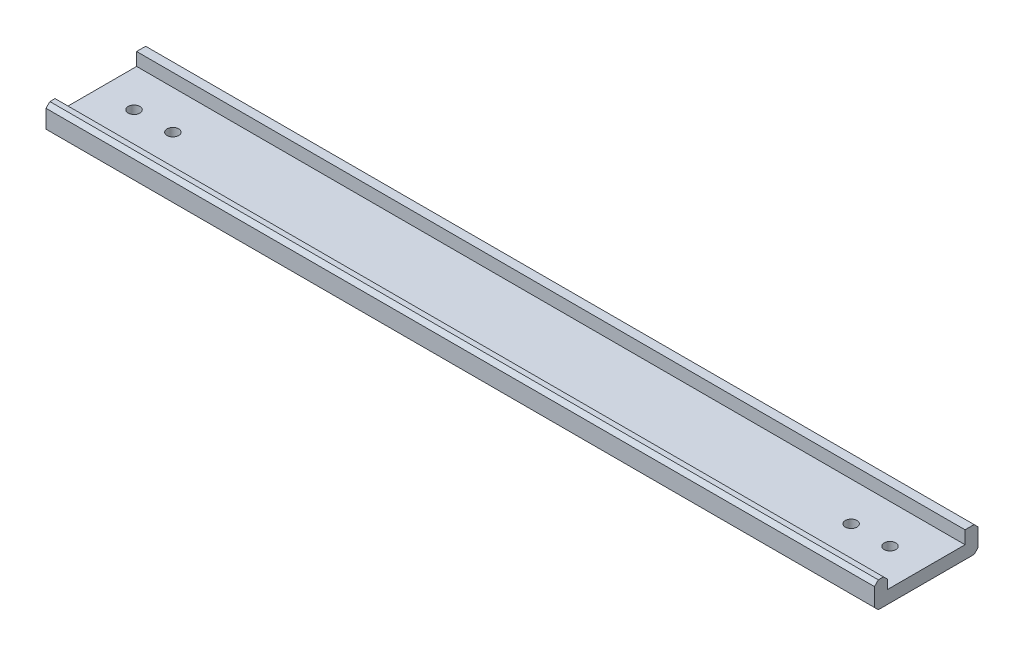
ISO-10303-21;
HEADER;
FILE_DESCRIPTION(('STEP AP214'),'2;1');
FILE_NAME('part.step','',(''),(''),'','','');
FILE_SCHEMA(('AUTOMOTIVE_DESIGN { 1 0 10303 214 1 1 1 1 }'));
ENDSEC;
DATA;
#1=APPLICATION_CONTEXT('core data for automotive mechanical design processes');
#2=APPLICATION_PROTOCOL_DEFINITION('international standard','automotive_design',2000,#1);
#3=PRODUCT_CONTEXT('',#1,'mechanical');
#4=PRODUCT('Part','Part','',(#3));
#5=PRODUCT_RELATED_PRODUCT_CATEGORY('part','',(#4));
#6=PRODUCT_DEFINITION_FORMATION('','',#4);
#7=PRODUCT_DEFINITION_CONTEXT('part definition',#1,'design');
#8=PRODUCT_DEFINITION('design','',#6,#7);
#9=PRODUCT_DEFINITION_SHAPE('','',#8);
#10=(LENGTH_UNIT() NAMED_UNIT(*) SI_UNIT(.MILLI.,.METRE.));
#11=(NAMED_UNIT(*) PLANE_ANGLE_UNIT() SI_UNIT($,.RADIAN.));
#12=(NAMED_UNIT(*) SI_UNIT($,.STERADIAN.) SOLID_ANGLE_UNIT());
#13=UNCERTAINTY_MEASURE_WITH_UNIT(LENGTH_MEASURE(1.E-05),#10,'distance_accuracy_value','');
#14=(GEOMETRIC_REPRESENTATION_CONTEXT(3) GLOBAL_UNCERTAINTY_ASSIGNED_CONTEXT((#13)) GLOBAL_UNIT_ASSIGNED_CONTEXT((#10,
#11,#12)) REPRESENTATION_CONTEXT('',''));
#15=CARTESIAN_POINT('',(0.,0.,0.));
#16=DIRECTION('',(0.,0.,1.));
#17=DIRECTION('',(1.,0.,0.));
#18=AXIS2_PLACEMENT_3D('',#15,#16,#17);
#19=CARTESIAN_POINT('',(160.,5.00000000000001,-15.));
#20=DIRECTION('',(0.,0.,-1.));
#21=DIRECTION('',(0.,1.,0.));
#22=AXIS2_PLACEMENT_3D('',#19,#20,#21);
#23=PLANE('',#22);
#24=DIRECTION('',(0.,-1.,0.));
#25=VECTOR('',#24,1.);
#26=CARTESIAN_POINT('',(-160.,5.00000000000001,-15.));
#27=LINE('',#26,#25);
#28=CARTESIAN_POINT('',(-160.,5.00000000000001,-15.));
#29=VERTEX_POINT('',#28);
#30=CARTESIAN_POINT('',(-160.,0.,-15.));
#31=VERTEX_POINT('',#30);
#32=EDGE_CURVE('E164',#29,#31,#27,.T.);
#33=ORIENTED_EDGE('',*,*,#32,.T.);
#34=DIRECTION('',(-1.,0.,0.));
#35=VECTOR('',#34,1.);
#36=CARTESIAN_POINT('',(160.,0.,-15.));
#37=LINE('',#36,#35);
#38=CARTESIAN_POINT('',(160.,0.,-15.));
#39=VERTEX_POINT('',#38);
#40=EDGE_CURVE('E144',#39,#31,#37,.T.);
#41=ORIENTED_EDGE('',*,*,#40,.F.);
#42=DIRECTION('',(0.,-1.,0.));
#43=VECTOR('',#42,1.);
#44=CARTESIAN_POINT('',(160.,5.00000000000001,-15.));
#45=LINE('',#44,#43);
#46=CARTESIAN_POINT('',(160.,5.00000000000001,-15.));
#47=VERTEX_POINT('',#46);
#48=EDGE_CURVE('E152',#47,#39,#45,.T.);
#49=ORIENTED_EDGE('',*,*,#48,.F.);
#50=DIRECTION('',(-1.,0.,0.));
#51=VECTOR('',#50,1.);
#52=CARTESIAN_POINT('',(160.,5.00000000000001,-15.));
#53=LINE('',#52,#51);
#54=EDGE_CURVE('E172',#47,#29,#53,.T.);
#55=ORIENTED_EDGE('',*,*,#54,.T.);
#56=EDGE_LOOP('',(#33,#41,#49,#55));
#57=FACE_BOUND('',#56,.T.);
#58=ADVANCED_FACE('F40',(#57),#23,.F.);
#59=CARTESIAN_POINT('',(160.,0.,15.));
#60=DIRECTION('',(0.,-1.,0.));
#61=DIRECTION('',(0.,0.,-1.));
#62=AXIS2_PLACEMENT_3D('',#59,#60,#61);
#63=PLANE('',#62);
#64=CARTESIAN_POINT('',(-146.,0.,0.));
#65=DIRECTION('',(0.,1.,0.));
#66=DIRECTION('',(0.,0.,1.));
#67=AXIS2_PLACEMENT_3D('',#64,#65,#66);
#68=CIRCLE('',#67,2.25000000000001);
#69=CARTESIAN_POINT('',(-146.,0.,2.25000000000001));
#70=VERTEX_POINT('',#69);
#71=EDGE_CURVE('E236',#70,#70,#68,.T.);
#72=ORIENTED_EDGE('',*,*,#71,.F.);
#73=EDGE_LOOP('',(#72));
#74=FACE_BOUND('',#73,.T.);
#75=CARTESIAN_POINT('',(-131.,0.,0.));
#76=DIRECTION('',(0.,1.,0.));
#77=DIRECTION('',(0.,0.,1.));
#78=AXIS2_PLACEMENT_3D('',#75,#76,#77);
#79=CIRCLE('',#78,2.25000000000001);
#80=CARTESIAN_POINT('',(-131.,0.,2.25000000000001));
#81=VERTEX_POINT('',#80);
#82=EDGE_CURVE('E303',#81,#81,#79,.T.);
#83=ORIENTED_EDGE('',*,*,#82,.F.);
#84=EDGE_LOOP('',(#83));
#85=FACE_BOUND('',#84,.T.);
#86=CARTESIAN_POINT('',(131.,0.,0.));
#87=DIRECTION('',(0.,1.,0.));
#88=DIRECTION('',(0.,0.,1.));
#89=AXIS2_PLACEMENT_3D('',#86,#87,#88);
#90=CIRCLE('',#89,2.25000000000001);
#91=CARTESIAN_POINT('',(131.,0.,2.24999999999996));
#92=VERTEX_POINT('',#91);
#93=EDGE_CURVE('E299',#92,#92,#90,.T.);
#94=ORIENTED_EDGE('',*,*,#93,.F.);
#95=EDGE_LOOP('',(#94));
#96=FACE_BOUND('',#95,.T.);
#97=CARTESIAN_POINT('',(146.,0.,0.));
#98=DIRECTION('',(0.,1.,0.));
#99=DIRECTION('',(0.,0.,1.));
#100=AXIS2_PLACEMENT_3D('',#97,#98,#99);
#101=CIRCLE('',#100,2.25000000000001);
#102=CARTESIAN_POINT('',(146.,0.,2.24999999999996));
#103=VERTEX_POINT('',#102);
#104=EDGE_CURVE('E295',#103,#103,#101,.T.);
#105=ORIENTED_EDGE('',*,*,#104,.F.);
#106=EDGE_LOOP('',(#105));
#107=FACE_BOUND('',#106,.T.);
#108=DIRECTION('',(0.,0.,1.));
#109=VECTOR('',#108,1.);
#110=CARTESIAN_POINT('',(-160.,0.,15.));
#111=LINE('',#110,#109);
#112=CARTESIAN_POINT('',(-160.,0.,15.));
#113=VERTEX_POINT('',#112);
#114=EDGE_CURVE('E249',#31,#113,#111,.T.);
#115=ORIENTED_EDGE('',*,*,#114,.T.);
#116=DIRECTION('',(-1.,0.,0.));
#117=VECTOR('',#116,1.);
#118=CARTESIAN_POINT('',(160.,0.,15.));
#119=LINE('',#118,#117);
#120=CARTESIAN_POINT('',(160.,0.,15.));
#121=VERTEX_POINT('',#120);
#122=EDGE_CURVE('E147',#121,#113,#119,.T.);
#123=ORIENTED_EDGE('',*,*,#122,.F.);
#124=DIRECTION('',(0.,0.,1.));
#125=VECTOR('',#124,1.);
#126=CARTESIAN_POINT('',(160.,0.,15.));
#127=LINE('',#126,#125);
#128=EDGE_CURVE('E140',#39,#121,#127,.T.);
#129=ORIENTED_EDGE('',*,*,#128,.F.);
#130=ORIENTED_EDGE('',*,*,#40,.T.);
#131=EDGE_LOOP('',(#115,#123,#129,#130));
#132=FACE_BOUND('',#131,.T.);
#133=ADVANCED_FACE('F142',(#74,#85,#96,#107,#132),#63,.F.);
#134=CARTESIAN_POINT('',(160.,0.,15.));
#135=DIRECTION('',(0.,0.,1.));
#136=DIRECTION('',(1.,0.,0.));
#137=AXIS2_PLACEMENT_3D('',#134,#135,#136);
#138=PLANE('',#137);
#139=DIRECTION('',(0.,1.,0.));
#140=VECTOR('',#139,1.);
#141=CARTESIAN_POINT('',(-160.,0.,15.));
#142=LINE('',#141,#140);
#143=CARTESIAN_POINT('',(-160.,3.5,15.));
#144=VERTEX_POINT('',#143);
#145=EDGE_CURVE('E252',#113,#144,#142,.T.);
#146=ORIENTED_EDGE('',*,*,#145,.T.);
#147=DIRECTION('',(1.,0.,0.));
#148=VECTOR('',#147,1.);
#149=CARTESIAN_POINT('',(160.,3.5,15.));
#150=LINE('',#149,#148);
#151=CARTESIAN_POINT('',(160.,3.5,15.));
#152=VERTEX_POINT('',#151);
#153=EDGE_CURVE('E194',#144,#152,#150,.T.);
#154=ORIENTED_EDGE('',*,*,#153,.T.);
#155=DIRECTION('',(0.,1.,0.));
#156=VECTOR('',#155,1.);
#157=CARTESIAN_POINT('',(160.,0.,15.));
#158=LINE('',#157,#156);
#159=EDGE_CURVE('E151',#121,#152,#158,.T.);
#160=ORIENTED_EDGE('',*,*,#159,.F.);
#161=ORIENTED_EDGE('',*,*,#122,.T.);
#162=EDGE_LOOP('',(#146,#154,#160,#161));
#163=FACE_BOUND('',#162,.T.);
#164=ADVANCED_FACE('F316',(#163),#138,.F.);
#165=CARTESIAN_POINT('',(160.,5.,15.));
#166=DIRECTION('',(0.,-1.,0.));
#167=DIRECTION('',(0.,0.,-1.));
#168=AXIS2_PLACEMENT_3D('',#165,#166,#167);
#169=PLANE('',#168);
#170=DIRECTION('',(0.,0.,1.));
#171=VECTOR('',#170,1.);
#172=CARTESIAN_POINT('',(160.,5.,15.));
#173=LINE('',#172,#171);
#174=CARTESIAN_POINT('',(160.,5.,16.5));
#175=VERTEX_POINT('',#174);
#176=CARTESIAN_POINT('',(160.,5.,18.5));
#177=VERTEX_POINT('',#176);
#178=EDGE_CURVE('E289',#175,#177,#173,.T.);
#179=ORIENTED_EDGE('',*,*,#178,.F.);
#180=DIRECTION('',(-1.,0.,0.));
#181=VECTOR('',#180,1.);
#182=CARTESIAN_POINT('',(160.,5.,16.5));
#183=LINE('',#182,#181);
#184=CARTESIAN_POINT('',(-160.,5.,16.5));
#185=VERTEX_POINT('',#184);
#186=EDGE_CURVE('E170',#175,#185,#183,.T.);
#187=ORIENTED_EDGE('',*,*,#186,.T.);
#188=DIRECTION('',(0.,0.,1.));
#189=VECTOR('',#188,1.);
#190=CARTESIAN_POINT('',(-160.,5.,15.));
#191=LINE('',#190,#189);
#192=CARTESIAN_POINT('',(-160.,5.,18.5));
#193=VERTEX_POINT('',#192);
#194=EDGE_CURVE('E260',#185,#193,#191,.T.);
#195=ORIENTED_EDGE('',*,*,#194,.T.);
#196=DIRECTION('',(1.,0.,0.));
#197=VECTOR('',#196,1.);
#198=CARTESIAN_POINT('',(160.,5.,18.5));
#199=LINE('',#198,#197);
#200=EDGE_CURVE('E166',#193,#177,#199,.T.);
#201=ORIENTED_EDGE('',*,*,#200,.T.);
#202=EDGE_LOOP('',(#179,#187,#195,#201));
#203=FACE_BOUND('',#202,.T.);
#204=ADVANCED_FACE('F408',(#203),#169,.F.);
#205=CARTESIAN_POINT('',(160.,5.,20.));
#206=DIRECTION('',(0.,0.,-1.));
#207=DIRECTION('',(0.,1.,0.));
#208=AXIS2_PLACEMENT_3D('',#205,#206,#207);
#209=PLANE('',#208);
#210=DIRECTION('',(0.,-1.,0.));
#211=VECTOR('',#210,1.);
#212=CARTESIAN_POINT('',(160.,5.,20.));
#213=LINE('',#212,#211);
#214=CARTESIAN_POINT('',(160.,3.49999999999997,20.));
#215=VERTEX_POINT('',#214);
#216=CARTESIAN_POINT('',(160.,-3.5,20.));
#217=VERTEX_POINT('',#216);
#218=EDGE_CURVE('E283',#215,#217,#213,.T.);
#219=ORIENTED_EDGE('',*,*,#218,.F.);
#220=DIRECTION('',(-1.,0.,0.));
#221=VECTOR('',#220,1.);
#222=CARTESIAN_POINT('',(160.,3.49999999999997,20.));
#223=LINE('',#222,#221);
#224=CARTESIAN_POINT('',(-160.,3.49999999999997,20.));
#225=VERTEX_POINT('',#224);
#226=EDGE_CURVE('E224',#215,#225,#223,.T.);
#227=ORIENTED_EDGE('',*,*,#226,.T.);
#228=DIRECTION('',(0.,-1.,0.));
#229=VECTOR('',#228,1.);
#230=CARTESIAN_POINT('',(-160.,5.,20.));
#231=LINE('',#230,#229);
#232=CARTESIAN_POINT('',(-160.,-3.5,20.));
#233=VERTEX_POINT('',#232);
#234=EDGE_CURVE('E264',#225,#233,#231,.T.);
#235=ORIENTED_EDGE('',*,*,#234,.T.);
#236=DIRECTION('',(1.,0.,0.));
#237=VECTOR('',#236,1.);
#238=CARTESIAN_POINT('',(160.,-3.5,20.));
#239=LINE('',#238,#237);
#240=EDGE_CURVE('E221',#233,#217,#239,.T.);
#241=ORIENTED_EDGE('',*,*,#240,.T.);
#242=EDGE_LOOP('',(#219,#227,#235,#241));
#243=FACE_BOUND('',#242,.T.);
#244=ADVANCED_FACE('F335',(#243),#209,.F.);
#245=CARTESIAN_POINT('',(160.,-5.,20.));
#246=DIRECTION('',(0.,1.,0.));
#247=DIRECTION('',(0.,0.,1.));
#248=AXIS2_PLACEMENT_3D('',#245,#246,#247);
#249=PLANE('',#248);
#250=CARTESIAN_POINT('',(-146.,-5.,0.));
#251=DIRECTION('',(0.,1.,0.));
#252=DIRECTION('',(0.,0.,1.));
#253=AXIS2_PLACEMENT_3D('',#250,#251,#252);
#254=CIRCLE('',#253,2.25000000000001);
#255=CARTESIAN_POINT('',(-146.,-5.,2.25000000000001));
#256=VERTEX_POINT('',#255);
#257=EDGE_CURVE('E45',#256,#256,#254,.T.);
#258=ORIENTED_EDGE('',*,*,#257,.T.);
#259=EDGE_LOOP('',(#258));
#260=FACE_BOUND('',#259,.T.);
#261=CARTESIAN_POINT('',(-131.,-5.,0.));
#262=DIRECTION('',(0.,1.,0.));
#263=DIRECTION('',(0.,0.,1.));
#264=AXIS2_PLACEMENT_3D('',#261,#262,#263);
#265=CIRCLE('',#264,2.25000000000001);
#266=CARTESIAN_POINT('',(-131.,-5.,2.25000000000001));
#267=VERTEX_POINT('',#266);
#268=EDGE_CURVE('E239',#267,#267,#265,.T.);
#269=ORIENTED_EDGE('',*,*,#268,.T.);
#270=EDGE_LOOP('',(#269));
#271=FACE_BOUND('',#270,.T.);
#272=CARTESIAN_POINT('',(131.,-5.,0.));
#273=DIRECTION('',(0.,1.,0.));
#274=DIRECTION('',(0.,0.,1.));
#275=AXIS2_PLACEMENT_3D('',#272,#273,#274);
#276=CIRCLE('',#275,2.25000000000001);
#277=CARTESIAN_POINT('',(131.,-5.,2.24999999999996));
#278=VERTEX_POINT('',#277);
#279=EDGE_CURVE('E235',#278,#278,#276,.T.);
#280=ORIENTED_EDGE('',*,*,#279,.T.);
#281=EDGE_LOOP('',(#280));
#282=FACE_BOUND('',#281,.T.);
#283=CARTESIAN_POINT('',(146.,-5.,0.));
#284=DIRECTION('',(0.,1.,0.));
#285=DIRECTION('',(0.,0.,1.));
#286=AXIS2_PLACEMENT_3D('',#283,#284,#285);
#287=CIRCLE('',#286,2.25000000000001);
#288=CARTESIAN_POINT('',(146.,-5.,2.24999999999995));
#289=VERTEX_POINT('',#288);
#290=EDGE_CURVE('E231',#289,#289,#287,.T.);
#291=ORIENTED_EDGE('',*,*,#290,.T.);
#292=EDGE_LOOP('',(#291));
#293=FACE_BOUND('',#292,.T.);
#294=DIRECTION('',(0.,0.,-1.));
#295=VECTOR('',#294,1.);
#296=CARTESIAN_POINT('',(-160.,-5.,20.));
#297=LINE('',#296,#295);
#298=CARTESIAN_POINT('',(-160.,-5.,18.5));
#299=VERTEX_POINT('',#298);
#300=CARTESIAN_POINT('',(-160.,-4.99999999999999,-18.4999999999999));
#301=VERTEX_POINT('',#300);
#302=EDGE_CURVE('E268',#299,#301,#297,.T.);
#303=ORIENTED_EDGE('',*,*,#302,.T.);
#304=DIRECTION('',(1.,0.,0.));
#305=VECTOR('',#304,1.);
#306=CARTESIAN_POINT('',(160.,-4.99999999999999,-18.4999999999999));
#307=LINE('',#306,#305);
#308=CARTESIAN_POINT('',(160.,-4.99999999999999,-18.4999999999999));
#309=VERTEX_POINT('',#308);
#310=EDGE_CURVE('E11',#301,#309,#307,.T.);
#311=ORIENTED_EDGE('',*,*,#310,.T.);
#312=DIRECTION('',(0.,0.,-1.));
#313=VECTOR('',#312,1.);
#314=CARTESIAN_POINT('',(160.,-5.,20.));
#315=LINE('',#314,#313);
#316=CARTESIAN_POINT('',(160.,-5.,18.5));
#317=VERTEX_POINT('',#316);
#318=EDGE_CURVE('E280',#317,#309,#315,.T.);
#319=ORIENTED_EDGE('',*,*,#318,.F.);
#320=DIRECTION('',(-1.,0.,0.));
#321=VECTOR('',#320,1.);
#322=CARTESIAN_POINT('',(160.,-5.,18.5));
#323=LINE('',#322,#321);
#324=EDGE_CURVE('E51',#317,#299,#323,.T.);
#325=ORIENTED_EDGE('',*,*,#324,.T.);
#326=EDGE_LOOP('',(#303,#311,#319,#325));
#327=FACE_BOUND('',#326,.T.);
#328=ADVANCED_FACE('F331',(#260,#271,#282,#293,#327),#249,.F.);
#329=CARTESIAN_POINT('',(160.,-4.99999999999999,-20.));
#330=DIRECTION('',(0.,0.,1.));
#331=DIRECTION('',(0.,-1.,0.));
#332=AXIS2_PLACEMENT_3D('',#329,#330,#331);
#333=PLANE('',#332);
#334=DIRECTION('',(0.,1.,0.));
#335=VECTOR('',#334,1.);
#336=CARTESIAN_POINT('',(-160.,-4.99999999999999,-20.));
#337=LINE('',#336,#335);
#338=CARTESIAN_POINT('',(-160.,-3.49999999999991,-20.));
#339=VERTEX_POINT('',#338);
#340=CARTESIAN_POINT('',(-160.,3.49999999999995,-20.));
#341=VERTEX_POINT('',#340);
#342=EDGE_CURVE('E272',#339,#341,#337,.T.);
#343=ORIENTED_EDGE('',*,*,#342,.T.);
#344=DIRECTION('',(1.,0.,0.));
#345=VECTOR('',#344,1.);
#346=CARTESIAN_POINT('',(160.,3.49999999999995,-20.));
#347=LINE('',#346,#345);
#348=CARTESIAN_POINT('',(160.,3.49999999999995,-20.));
#349=VERTEX_POINT('',#348);
#350=EDGE_CURVE('E67',#341,#349,#347,.T.);
#351=ORIENTED_EDGE('',*,*,#350,.T.);
#352=DIRECTION('',(0.,1.,0.));
#353=VECTOR('',#352,1.);
#354=CARTESIAN_POINT('',(160.,-4.99999999999999,-20.));
#355=LINE('',#354,#353);
#356=CARTESIAN_POINT('',(160.,-3.49999999999991,-20.));
#357=VERTEX_POINT('',#356);
#358=EDGE_CURVE('E278',#357,#349,#355,.T.);
#359=ORIENTED_EDGE('',*,*,#358,.F.);
#360=DIRECTION('',(-1.,0.,0.));
#361=VECTOR('',#360,1.);
#362=CARTESIAN_POINT('',(160.,-3.49999999999991,-20.));
#363=LINE('',#362,#361);
#364=EDGE_CURVE('E215',#357,#339,#363,.T.);
#365=ORIENTED_EDGE('',*,*,#364,.T.);
#366=EDGE_LOOP('',(#343,#351,#359,#365));
#367=FACE_BOUND('',#366,.T.);
#368=ADVANCED_FACE('F334',(#367),#333,.F.);
#369=CARTESIAN_POINT('',(160.,5.00000000000001,-20.));
#370=DIRECTION('',(0.,-1.,0.));
#371=DIRECTION('',(0.,0.,-1.));
#372=AXIS2_PLACEMENT_3D('',#369,#370,#371);
#373=PLANE('',#372);
#374=DIRECTION('',(0.,0.,1.));
#375=VECTOR('',#374,1.);
#376=CARTESIAN_POINT('',(160.,5.00000000000001,-20.));
#377=LINE('',#376,#375);
#378=CARTESIAN_POINT('',(160.,5.00000000000001,-18.4999999999999));
#379=VERTEX_POINT('',#378);
#380=EDGE_CURVE('E156',#379,#47,#377,.T.);
#381=ORIENTED_EDGE('',*,*,#380,.F.);
#382=DIRECTION('',(-1.,0.,0.));
#383=VECTOR('',#382,1.);
#384=CARTESIAN_POINT('',(160.,5.00000000000001,-18.4999999999999));
#385=LINE('',#384,#383);
#386=CARTESIAN_POINT('',(-160.,5.00000000000001,-18.4999999999999));
#387=VERTEX_POINT('',#386);
#388=EDGE_CURVE('E211',#379,#387,#385,.T.);
#389=ORIENTED_EDGE('',*,*,#388,.T.);
#390=DIRECTION('',(0.,0.,1.));
#391=VECTOR('',#390,1.);
#392=CARTESIAN_POINT('',(-160.,5.00000000000001,-20.));
#393=LINE('',#392,#391);
#394=EDGE_CURVE('E161',#387,#29,#393,.T.);
#395=ORIENTED_EDGE('',*,*,#394,.T.);
#396=ORIENTED_EDGE('',*,*,#54,.F.);
#397=EDGE_LOOP('',(#381,#389,#395,#396));
#398=FACE_BOUND('',#397,.T.);
#399=ADVANCED_FACE('F354',(#398),#373,.F.);
#400=CARTESIAN_POINT('',(160.,0.,0.));
#401=DIRECTION('',(1.,0.,0.));
#402=DIRECTION('',(0.,0.,-1.));
#403=AXIS2_PLACEMENT_3D('',#400,#401,#402);
#404=PLANE('',#403);
#405=ORIENTED_EDGE('',*,*,#159,.T.);
#406=DIRECTION('',(0.,-0.707106781186541,-0.707106781186554));
#407=VECTOR('',#406,1.);
#408=CARTESIAN_POINT('',(160.,-5.74999999999997,5.74999999999986));
#409=LINE('',#408,#407);
#410=EDGE_CURVE('E208',#152,#175,#409,.F.);
#411=ORIENTED_EDGE('',*,*,#410,.T.);
#412=ORIENTED_EDGE('',*,*,#178,.T.);
#413=DIRECTION('',(0.,0.707106781186554,-0.707106781186541));
#414=VECTOR('',#413,1.);
#415=CARTESIAN_POINT('',(160.,11.75,11.7500000000002));
#416=LINE('',#415,#414);
#417=EDGE_CURVE('E203',#177,#215,#416,.F.);
#418=ORIENTED_EDGE('',*,*,#417,.T.);
#419=ORIENTED_EDGE('',*,*,#218,.T.);
#420=DIRECTION('',(0.,0.707106781186548,0.707106781186547));
#421=VECTOR('',#420,1.);
#422=CARTESIAN_POINT('',(160.,-11.75,11.75));
#423=LINE('',#422,#421);
#424=EDGE_CURVE('E197',#217,#317,#423,.F.);
#425=ORIENTED_EDGE('',*,*,#424,.T.);
#426=ORIENTED_EDGE('',*,*,#318,.T.);
#427=DIRECTION('',(0.,-0.707106781186541,0.707106781186554));
#428=VECTOR('',#427,1.);
#429=CARTESIAN_POINT('',(160.,-11.75,-11.7499999999998));
#430=LINE('',#429,#428);
#431=EDGE_CURVE('E200',#309,#357,#430,.F.);
#432=ORIENTED_EDGE('',*,*,#431,.T.);
#433=ORIENTED_EDGE('',*,*,#358,.T.);
#434=DIRECTION('',(0.,-0.707106781186548,-0.707106781186547));
#435=VECTOR('',#434,1.);
#436=CARTESIAN_POINT('',(160.,11.75,-11.75));
#437=LINE('',#436,#435);
#438=EDGE_CURVE('E59',#349,#379,#437,.F.);
#439=ORIENTED_EDGE('',*,*,#438,.T.);
#440=ORIENTED_EDGE('',*,*,#380,.T.);
#441=ORIENTED_EDGE('',*,*,#48,.T.);
#442=ORIENTED_EDGE('',*,*,#128,.T.);
#443=EDGE_LOOP('',(#405,#411,#412,#418,#419,#425,#426,#432,#433,#439,#440,#441,#442));
#444=FACE_BOUND('',#443,.T.);
#445=ADVANCED_FACE('F155',(#444),#404,.T.);
#446=CARTESIAN_POINT('',(-160.,0.,0.));
#447=DIRECTION('',(1.,0.,0.));
#448=DIRECTION('',(0.,0.,-1.));
#449=AXIS2_PLACEMENT_3D('',#446,#447,#448);
#450=PLANE('',#449);
#451=ORIENTED_EDGE('',*,*,#194,.F.);
#452=DIRECTION('',(0.,0.707106781186541,0.707106781186554));
#453=VECTOR('',#452,1.);
#454=CARTESIAN_POINT('',(-160.,5.,16.5));
#455=LINE('',#454,#453);
#456=EDGE_CURVE('E191',#185,#144,#455,.F.);
#457=ORIENTED_EDGE('',*,*,#456,.T.);
#458=ORIENTED_EDGE('',*,*,#145,.F.);
#459=ORIENTED_EDGE('',*,*,#114,.F.);
#460=ORIENTED_EDGE('',*,*,#32,.F.);
#461=ORIENTED_EDGE('',*,*,#394,.F.);
#462=DIRECTION('',(0.,0.707106781186548,0.707106781186547));
#463=VECTOR('',#462,1.);
#464=CARTESIAN_POINT('',(-160.,5.00000000000001,-18.4999999999999));
#465=LINE('',#464,#463);
#466=EDGE_CURVE('E188',#387,#341,#465,.F.);
#467=ORIENTED_EDGE('',*,*,#466,.T.);
#468=ORIENTED_EDGE('',*,*,#342,.F.);
#469=DIRECTION('',(0.,0.707106781186541,-0.707106781186554));
#470=VECTOR('',#469,1.);
#471=CARTESIAN_POINT('',(-160.,-3.49999999999991,-20.));
#472=LINE('',#471,#470);
#473=EDGE_CURVE('E182',#339,#301,#472,.F.);
#474=ORIENTED_EDGE('',*,*,#473,.T.);
#475=ORIENTED_EDGE('',*,*,#302,.F.);
#476=DIRECTION('',(0.,-0.707106781186548,-0.707106781186547));
#477=VECTOR('',#476,1.);
#478=CARTESIAN_POINT('',(-160.,-5.,18.5));
#479=LINE('',#478,#477);
#480=EDGE_CURVE('E179',#299,#233,#479,.F.);
#481=ORIENTED_EDGE('',*,*,#480,.T.);
#482=ORIENTED_EDGE('',*,*,#234,.F.);
#483=DIRECTION('',(0.,-0.707106781186554,0.707106781186541));
#484=VECTOR('',#483,1.);
#485=CARTESIAN_POINT('',(-160.,3.49999999999997,20.));
#486=LINE('',#485,#484);
#487=EDGE_CURVE('E185',#225,#193,#486,.F.);
#488=ORIENTED_EDGE('',*,*,#487,.T.);
#489=EDGE_LOOP('',(#451,#457,#458,#459,#460,#461,#467,#468,#474,#475,#481,#482,#488));
#490=FACE_BOUND('',#489,.T.);
#491=ADVANCED_FACE('F348',(#490),#450,.F.);
#492=CARTESIAN_POINT('',(160.,5.,16.5));
#493=DIRECTION('',(0.,-0.707106781186554,0.707106781186541));
#494=DIRECTION('',(-1.,0.,0.));
#495=AXIS2_PLACEMENT_3D('',#492,#493,#494);
#496=PLANE('',#495);
#497=ORIENTED_EDGE('',*,*,#410,.F.);
#498=ORIENTED_EDGE('',*,*,#153,.F.);
#499=ORIENTED_EDGE('',*,*,#456,.F.);
#500=ORIENTED_EDGE('',*,*,#186,.F.);
#501=EDGE_LOOP('',(#497,#498,#499,#500));
#502=FACE_BOUND('',#501,.T.);
#503=ADVANCED_FACE('F371',(#502),#496,.F.);
#504=CARTESIAN_POINT('',(160.,5.00000000000001,-18.4999999999999));
#505=DIRECTION('',(0.,-0.707106781186547,0.707106781186548));
#506=DIRECTION('',(-1.,0.,0.));
#507=AXIS2_PLACEMENT_3D('',#504,#505,#506);
#508=PLANE('',#507);
#509=ORIENTED_EDGE('',*,*,#438,.F.);
#510=ORIENTED_EDGE('',*,*,#350,.F.);
#511=ORIENTED_EDGE('',*,*,#466,.F.);
#512=ORIENTED_EDGE('',*,*,#388,.F.);
#513=EDGE_LOOP('',(#509,#510,#511,#512));
#514=FACE_BOUND('',#513,.T.);
#515=ADVANCED_FACE('F352',(#514),#508,.F.);
#516=CARTESIAN_POINT('',(160.,3.49999999999997,20.));
#517=DIRECTION('',(0.,-0.707106781186541,-0.707106781186554));
#518=DIRECTION('',(-1.,0.,0.));
#519=AXIS2_PLACEMENT_3D('',#516,#517,#518);
#520=PLANE('',#519);
#521=ORIENTED_EDGE('',*,*,#417,.F.);
#522=ORIENTED_EDGE('',*,*,#200,.F.);
#523=ORIENTED_EDGE('',*,*,#487,.F.);
#524=ORIENTED_EDGE('',*,*,#226,.F.);
#525=EDGE_LOOP('',(#521,#522,#523,#524));
#526=FACE_BOUND('',#525,.T.);
#527=ADVANCED_FACE('F383',(#526),#520,.F.);
#528=CARTESIAN_POINT('',(160.,-3.49999999999991,-20.));
#529=DIRECTION('',(0.,0.707106781186554,0.707106781186541));
#530=DIRECTION('',(-1.,0.,0.));
#531=AXIS2_PLACEMENT_3D('',#528,#529,#530);
#532=PLANE('',#531);
#533=ORIENTED_EDGE('',*,*,#431,.F.);
#534=ORIENTED_EDGE('',*,*,#310,.F.);
#535=ORIENTED_EDGE('',*,*,#473,.F.);
#536=ORIENTED_EDGE('',*,*,#364,.F.);
#537=EDGE_LOOP('',(#533,#534,#535,#536));
#538=FACE_BOUND('',#537,.T.);
#539=ADVANCED_FACE('F344',(#538),#532,.F.);
#540=CARTESIAN_POINT('',(160.,-5.,18.5));
#541=DIRECTION('',(0.,0.707106781186547,-0.707106781186548));
#542=DIRECTION('',(-1.,0.,0.));
#543=AXIS2_PLACEMENT_3D('',#540,#541,#542);
#544=PLANE('',#543);
#545=ORIENTED_EDGE('',*,*,#424,.F.);
#546=ORIENTED_EDGE('',*,*,#240,.F.);
#547=ORIENTED_EDGE('',*,*,#480,.F.);
#548=ORIENTED_EDGE('',*,*,#324,.F.);
#549=EDGE_LOOP('',(#545,#546,#547,#548));
#550=FACE_BOUND('',#549,.T.);
#551=ADVANCED_FACE('F43',(#550),#544,.F.);
#552=CARTESIAN_POINT('',(146.,-320.,-1.12422576161727E-13));
#553=DIRECTION('',(0.,1.,0.));
#554=DIRECTION('',(0.,0.,1.));
#555=AXIS2_PLACEMENT_3D('',#552,#553,#554);
#556=CYLINDRICAL_SURFACE('',#555,2.25000000000001);
#557=ORIENTED_EDGE('',*,*,#104,.T.);
#558=EDGE_LOOP('',(#557));
#559=FACE_BOUND('',#558,.T.);
#560=ORIENTED_EDGE('',*,*,#290,.F.);
#561=EDGE_LOOP('',(#560));
#562=FACE_BOUND('',#561,.T.);
#563=ADVANCED_FACE('F324',(#559,#562),#556,.F.);
#564=CARTESIAN_POINT('',(131.,-320.,-1.06911665565564E-13));
#565=DIRECTION('',(0.,1.,0.));
#566=DIRECTION('',(0.,0.,1.));
#567=AXIS2_PLACEMENT_3D('',#564,#565,#566);
#568=CYLINDRICAL_SURFACE('',#567,2.25000000000001);
#569=ORIENTED_EDGE('',*,*,#93,.T.);
#570=EDGE_LOOP('',(#569));
#571=FACE_BOUND('',#570,.T.);
#572=ORIENTED_EDGE('',*,*,#279,.F.);
#573=EDGE_LOOP('',(#572));
#574=FACE_BOUND('',#573,.T.);
#575=ADVANCED_FACE('F327',(#571,#574),#568,.F.);
#576=CARTESIAN_POINT('',(-131.,-320.,0.));
#577=DIRECTION('',(0.,1.,0.));
#578=DIRECTION('',(0.,0.,1.));
#579=AXIS2_PLACEMENT_3D('',#576,#577,#578);
#580=CYLINDRICAL_SURFACE('',#579,2.25000000000001);
#581=ORIENTED_EDGE('',*,*,#82,.T.);
#582=EDGE_LOOP('',(#581));
#583=FACE_BOUND('',#582,.T.);
#584=ORIENTED_EDGE('',*,*,#268,.F.);
#585=EDGE_LOOP('',(#584));
#586=FACE_BOUND('',#585,.T.);
#587=ADVANCED_FACE('F513',(#583,#586),#580,.F.);
#588=CARTESIAN_POINT('',(-146.,-320.,0.));
#589=DIRECTION('',(0.,1.,0.));
#590=DIRECTION('',(0.,0.,1.));
#591=AXIS2_PLACEMENT_3D('',#588,#589,#590);
#592=CYLINDRICAL_SURFACE('',#591,2.25000000000001);
#593=ORIENTED_EDGE('',*,*,#71,.T.);
#594=EDGE_LOOP('',(#593));
#595=FACE_BOUND('',#594,.T.);
#596=ORIENTED_EDGE('',*,*,#257,.F.);
#597=EDGE_LOOP('',(#596));
#598=FACE_BOUND('',#597,.T.);
#599=ADVANCED_FACE('F311',(#595,#598),#592,.F.);
#600=CLOSED_SHELL('',(#58,#133,#164,#204,#244,#328,#368,#399,#445,#491,#503,#515,#527,#539,#551,
#563,#575,#587,#599));
#601=MANIFOLD_SOLID_BREP('B2',#600);
#602=ADVANCED_BREP_SHAPE_REPRESENTATION('',(#18,#601),#14);
#603=SHAPE_DEFINITION_REPRESENTATION(#9,#602);
ENDSEC;
END-ISO-10303-21;
